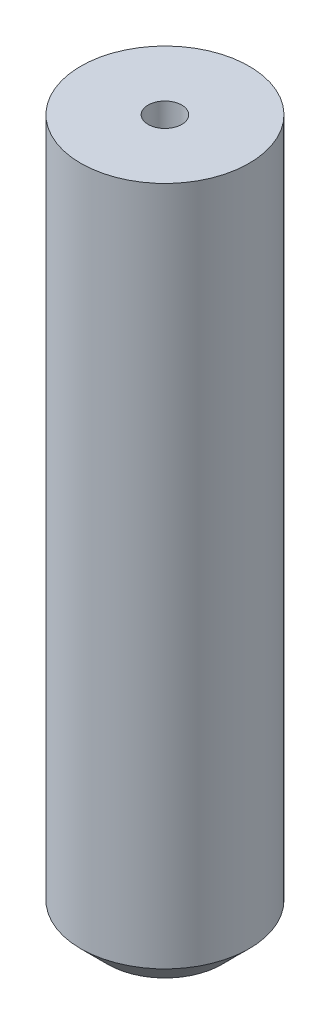
ISO-10303-21;
HEADER;
FILE_DESCRIPTION(('STEP AP214'),'2;1');
FILE_NAME('part.step','',(''),(''),'','','');
FILE_SCHEMA(('AUTOMOTIVE_DESIGN { 1 0 10303 214 1 1 1 1 }'));
ENDSEC;
DATA;
#1=APPLICATION_CONTEXT('core data for automotive mechanical design processes');
#2=APPLICATION_PROTOCOL_DEFINITION('international standard','automotive_design',2000,#1);
#3=PRODUCT_CONTEXT('',#1,'mechanical');
#4=PRODUCT('Part','Part','',(#3));
#5=PRODUCT_RELATED_PRODUCT_CATEGORY('part','',(#4));
#6=PRODUCT_DEFINITION_FORMATION('','',#4);
#7=PRODUCT_DEFINITION_CONTEXT('part definition',#1,'design');
#8=PRODUCT_DEFINITION('design','',#6,#7);
#9=PRODUCT_DEFINITION_SHAPE('','',#8);
#10=(LENGTH_UNIT() NAMED_UNIT(*) SI_UNIT(.MILLI.,.METRE.));
#11=(NAMED_UNIT(*) PLANE_ANGLE_UNIT() SI_UNIT($,.RADIAN.));
#12=(NAMED_UNIT(*) SI_UNIT($,.STERADIAN.) SOLID_ANGLE_UNIT());
#13=UNCERTAINTY_MEASURE_WITH_UNIT(LENGTH_MEASURE(1.E-05),#10,'distance_accuracy_value','');
#14=(GEOMETRIC_REPRESENTATION_CONTEXT(3) GLOBAL_UNCERTAINTY_ASSIGNED_CONTEXT((#13)) GLOBAL_UNIT_ASSIGNED_CONTEXT((#10,
#11,#12)) REPRESENTATION_CONTEXT('',''));
#15=CARTESIAN_POINT('',(0.,0.,0.));
#16=DIRECTION('',(0.,0.,1.));
#17=DIRECTION('',(1.,0.,0.));
#18=AXIS2_PLACEMENT_3D('',#15,#16,#17);
#19=CARTESIAN_POINT('',(0.,105.,0.));
#20=DIRECTION('',(0.,-1.,0.));
#21=DIRECTION('',(0.,0.,-1.));
#22=AXIS2_PLACEMENT_3D('',#19,#20,#21);
#23=CYLINDRICAL_SURFACE('',#22,12.5);
#24=CARTESIAN_POINT('',(0.,3.99999999999998,0.));
#25=DIRECTION('',(0.,1.,0.));
#26=DIRECTION('',(0.,0.,1.));
#27=AXIS2_PLACEMENT_3D('',#24,#25,#26);
#28=CIRCLE('',#27,12.5);
#29=CARTESIAN_POINT('',(0.,3.99999999999998,12.5));
#30=VERTEX_POINT('',#29);
#31=EDGE_CURVE('E49',#30,#30,#28,.T.);
#32=ORIENTED_EDGE('',*,*,#31,.T.);
#33=EDGE_LOOP('',(#32));
#34=FACE_BOUND('',#33,.T.);
#35=CARTESIAN_POINT('',(0.,105.,0.));
#36=DIRECTION('',(0.,1.,0.));
#37=DIRECTION('',(0.,0.,1.));
#38=AXIS2_PLACEMENT_3D('',#35,#36,#37);
#39=CIRCLE('',#38,12.5);
#40=CARTESIAN_POINT('',(0.,105.,12.5));
#41=VERTEX_POINT('',#40);
#42=EDGE_CURVE('E53',#41,#41,#39,.T.);
#43=ORIENTED_EDGE('',*,*,#42,.F.);
#44=EDGE_LOOP('',(#43));
#45=FACE_BOUND('',#44,.T.);
#46=ADVANCED_FACE('F41',(#34,#45),#23,.T.);
#47=CARTESIAN_POINT('',(0.,105.,0.));
#48=DIRECTION('',(0.,1.,0.));
#49=DIRECTION('',(0.,0.,1.));
#50=AXIS2_PLACEMENT_3D('',#47,#48,#49);
#51=PLANE('',#50);
#52=CARTESIAN_POINT('',(0.,105.,0.));
#53=DIRECTION('',(0.,1.,0.));
#54=DIRECTION('',(0.,0.,1.));
#55=AXIS2_PLACEMENT_3D('',#52,#53,#54);
#56=CIRCLE('',#55,2.5);
#57=CARTESIAN_POINT('',(0.,105.,2.5));
#58=VERTEX_POINT('',#57);
#59=EDGE_CURVE('E60',#58,#58,#56,.T.);
#60=ORIENTED_EDGE('',*,*,#59,.F.);
#61=EDGE_LOOP('',(#60));
#62=FACE_BOUND('',#61,.T.);
#63=ORIENTED_EDGE('',*,*,#42,.T.);
#64=EDGE_LOOP('',(#63));
#65=FACE_BOUND('',#64,.T.);
#66=ADVANCED_FACE('F74',(#62,#65),#51,.T.);
#67=CARTESIAN_POINT('',(0.,0.,0.));
#68=DIRECTION('',(0.,1.,0.));
#69=DIRECTION('',(0.,0.,1.));
#70=AXIS2_PLACEMENT_3D('',#67,#68,#69);
#71=PLANE('',#70);
#72=CARTESIAN_POINT('',(0.,0.,0.));
#73=DIRECTION('',(0.,1.,0.));
#74=DIRECTION('',(0.,0.,1.));
#75=AXIS2_PLACEMENT_3D('',#72,#73,#74);
#76=CIRCLE('',#75,8.50000000000001);
#77=CARTESIAN_POINT('',(0.,0.,8.50000000000001));
#78=VERTEX_POINT('',#77);
#79=EDGE_CURVE('E10',#78,#78,#76,.F.);
#80=ORIENTED_EDGE('',*,*,#79,.T.);
#81=EDGE_LOOP('',(#80));
#82=FACE_BOUND('',#81,.T.);
#83=CARTESIAN_POINT('',(0.,0.,0.));
#84=DIRECTION('',(0.,1.,0.));
#85=DIRECTION('',(0.,0.,1.));
#86=AXIS2_PLACEMENT_3D('',#83,#84,#85);
#87=CIRCLE('',#86,2.5);
#88=CARTESIAN_POINT('',(0.,0.,2.5));
#89=VERTEX_POINT('',#88);
#90=EDGE_CURVE('E57',#89,#89,#87,.T.);
#91=ORIENTED_EDGE('',*,*,#90,.T.);
#92=EDGE_LOOP('',(#91));
#93=FACE_BOUND('',#92,.T.);
#94=ADVANCED_FACE('F66',(#82,#93),#71,.F.);
#95=CARTESIAN_POINT('',(0.,0.,0.));
#96=DIRECTION('',(0.,1.,0.));
#97=DIRECTION('',(0.,0.,1.));
#98=AXIS2_PLACEMENT_3D('',#95,#96,#97);
#99=CYLINDRICAL_SURFACE('',#98,2.5);
#100=ORIENTED_EDGE('',*,*,#90,.F.);
#101=EDGE_LOOP('',(#100));
#102=FACE_BOUND('',#101,.T.);
#103=ORIENTED_EDGE('',*,*,#59,.T.);
#104=EDGE_LOOP('',(#103));
#105=FACE_BOUND('',#104,.T.);
#106=ADVANCED_FACE('F68',(#102,#105),#99,.F.);
#107=CARTESIAN_POINT('',(0.,3.99999999999998,0.));
#108=DIRECTION('',(0.,1.,0.));
#109=DIRECTION('',(0.,0.,1.));
#110=AXIS2_PLACEMENT_3D('',#107,#108,#109);
#111=CONICAL_SURFACE('',#110,12.5,0.78539816339745);
#112=ORIENTED_EDGE('',*,*,#79,.F.);
#113=EDGE_LOOP('',(#112));
#114=FACE_BOUND('',#113,.T.);
#115=ORIENTED_EDGE('',*,*,#31,.F.);
#116=EDGE_LOOP('',(#115));
#117=FACE_BOUND('',#116,.T.);
#118=ADVANCED_FACE('F44',(#114,#117),#111,.T.);
#119=CLOSED_SHELL('',(#46,#66,#94,#106,#118));
#120=MANIFOLD_SOLID_BREP('B2',#119);
#121=ADVANCED_BREP_SHAPE_REPRESENTATION('',(#18,#120),#14);
#122=SHAPE_DEFINITION_REPRESENTATION(#9,#121);
ENDSEC;
END-ISO-10303-21;
